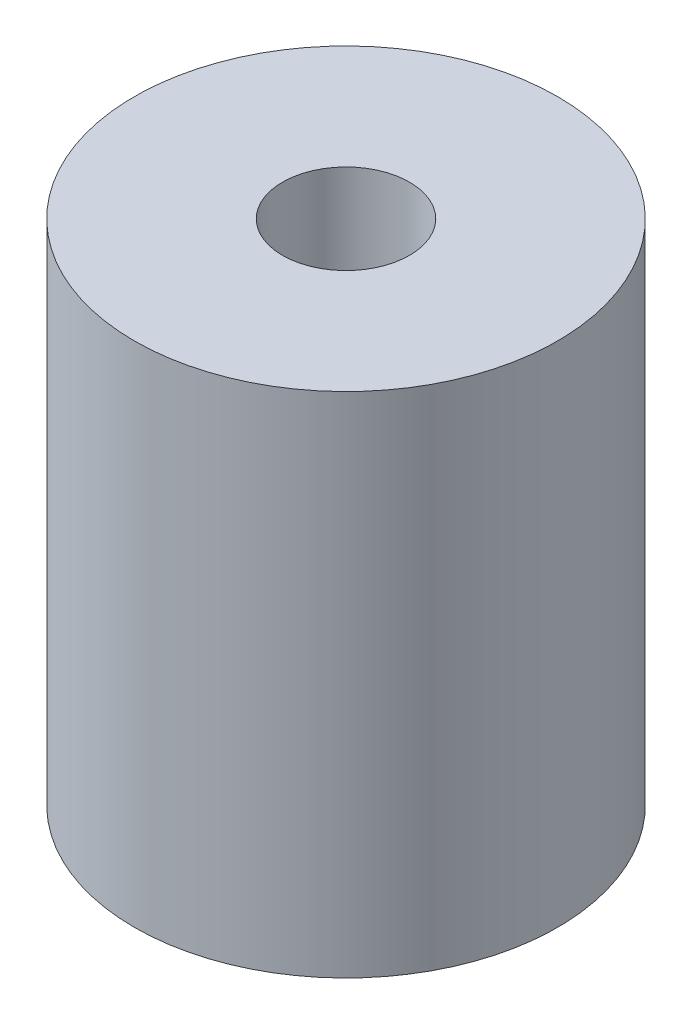
ISO-10303-21;
HEADER;
FILE_DESCRIPTION(('STEP AP214'),'2;1');
FILE_NAME('part.step','',(''),(''),'','','');
FILE_SCHEMA(('AUTOMOTIVE_DESIGN { 1 0 10303 214 1 1 1 1 }'));
ENDSEC;
DATA;
#1=APPLICATION_CONTEXT('core data for automotive mechanical design processes');
#2=APPLICATION_PROTOCOL_DEFINITION('international standard','automotive_design',2000,#1);
#3=PRODUCT_CONTEXT('',#1,'mechanical');
#4=PRODUCT('Part','Part','',(#3));
#5=PRODUCT_RELATED_PRODUCT_CATEGORY('part','',(#4));
#6=PRODUCT_DEFINITION_FORMATION('','',#4);
#7=PRODUCT_DEFINITION_CONTEXT('part definition',#1,'design');
#8=PRODUCT_DEFINITION('design','',#6,#7);
#9=PRODUCT_DEFINITION_SHAPE('','',#8);
#10=(LENGTH_UNIT() NAMED_UNIT(*) SI_UNIT(.MILLI.,.METRE.));
#11=(NAMED_UNIT(*) PLANE_ANGLE_UNIT() SI_UNIT($,.RADIAN.));
#12=(NAMED_UNIT(*) SI_UNIT($,.STERADIAN.) SOLID_ANGLE_UNIT());
#13=UNCERTAINTY_MEASURE_WITH_UNIT(LENGTH_MEASURE(1.E-05),#10,'distance_accuracy_value','');
#14=(GEOMETRIC_REPRESENTATION_CONTEXT(3) GLOBAL_UNCERTAINTY_ASSIGNED_CONTEXT((#13)) GLOBAL_UNIT_ASSIGNED_CONTEXT((#10,
#11,#12)) REPRESENTATION_CONTEXT('',''));
#15=CARTESIAN_POINT('',(0.,0.,0.));
#16=DIRECTION('',(0.,0.,1.));
#17=DIRECTION('',(1.,0.,0.));
#18=AXIS2_PLACEMENT_3D('',#15,#16,#17);
#19=CARTESIAN_POINT('',(0.,12.,0.));
#20=DIRECTION('',(0.,1.,0.));
#21=DIRECTION('',(0.,0.,1.));
#22=AXIS2_PLACEMENT_3D('',#19,#20,#21);
#23=PLANE('',#22);
#24=CARTESIAN_POINT('',(0.,12.,0.));
#25=DIRECTION('',(0.,1.,0.));
#26=DIRECTION('',(0.,0.,1.));
#27=AXIS2_PLACEMENT_3D('',#24,#25,#26);
#28=CIRCLE('',#27,5.);
#29=CARTESIAN_POINT('',(0.,12.,5.));
#30=VERTEX_POINT('',#29);
#31=EDGE_CURVE('E10',#30,#30,#28,.T.);
#32=ORIENTED_EDGE('',*,*,#31,.T.);
#33=EDGE_LOOP('',(#32));
#34=FACE_BOUND('',#33,.T.);
#35=CARTESIAN_POINT('',(0.,12.,0.));
#36=DIRECTION('',(0.,1.,0.));
#37=DIRECTION('',(0.,0.,1.));
#38=AXIS2_PLACEMENT_3D('',#35,#36,#37);
#39=CIRCLE('',#38,1.5);
#40=CARTESIAN_POINT('',(0.,12.,1.5));
#41=VERTEX_POINT('',#40);
#42=EDGE_CURVE('E50',#41,#41,#39,.T.);
#43=ORIENTED_EDGE('',*,*,#42,.F.);
#44=EDGE_LOOP('',(#43));
#45=FACE_BOUND('',#44,.T.);
#46=ADVANCED_FACE('F37',(#34,#45),#23,.T.);
#47=CARTESIAN_POINT('',(0.,0.,0.));
#48=DIRECTION('',(0.,1.,0.));
#49=DIRECTION('',(0.,0.,1.));
#50=AXIS2_PLACEMENT_3D('',#47,#48,#49);
#51=PLANE('',#50);
#52=CARTESIAN_POINT('',(0.,0.,0.));
#53=DIRECTION('',(0.,1.,0.));
#54=DIRECTION('',(0.,0.,1.));
#55=AXIS2_PLACEMENT_3D('',#52,#53,#54);
#56=CIRCLE('',#55,5.);
#57=CARTESIAN_POINT('',(0.,0.,5.));
#58=VERTEX_POINT('',#57);
#59=EDGE_CURVE('E41',#58,#58,#56,.T.);
#60=ORIENTED_EDGE('',*,*,#59,.F.);
#61=EDGE_LOOP('',(#60));
#62=FACE_BOUND('',#61,.T.);
#63=CARTESIAN_POINT('',(0.,0.,0.));
#64=DIRECTION('',(0.,1.,0.));
#65=DIRECTION('',(0.,0.,1.));
#66=AXIS2_PLACEMENT_3D('',#63,#64,#65);
#67=CIRCLE('',#66,1.5);
#68=CARTESIAN_POINT('',(0.,0.,1.5));
#69=VERTEX_POINT('',#68);
#70=EDGE_CURVE('E52',#69,#69,#67,.T.);
#71=ORIENTED_EDGE('',*,*,#70,.T.);
#72=EDGE_LOOP('',(#71));
#73=FACE_BOUND('',#72,.T.);
#74=ADVANCED_FACE('F64',(#62,#73),#51,.F.);
#75=CARTESIAN_POINT('',(0.,12.,0.));
#76=DIRECTION('',(0.,-1.,0.));
#77=DIRECTION('',(0.,0.,-1.));
#78=AXIS2_PLACEMENT_3D('',#75,#76,#77);
#79=CYLINDRICAL_SURFACE('',#78,5.);
#80=ORIENTED_EDGE('',*,*,#31,.F.);
#81=EDGE_LOOP('',(#80));
#82=FACE_BOUND('',#81,.T.);
#83=ORIENTED_EDGE('',*,*,#59,.T.);
#84=EDGE_LOOP('',(#83));
#85=FACE_BOUND('',#84,.T.);
#86=ADVANCED_FACE('F39',(#82,#85),#79,.T.);
#87=CARTESIAN_POINT('',(0.,12.,0.));
#88=DIRECTION('',(0.,-1.,0.));
#89=DIRECTION('',(0.,0.,-1.));
#90=AXIS2_PLACEMENT_3D('',#87,#88,#89);
#91=CYLINDRICAL_SURFACE('',#90,1.5);
#92=ORIENTED_EDGE('',*,*,#42,.T.);
#93=EDGE_LOOP('',(#92));
#94=FACE_BOUND('',#93,.T.);
#95=ORIENTED_EDGE('',*,*,#70,.F.);
#96=EDGE_LOOP('',(#95));
#97=FACE_BOUND('',#96,.T.);
#98=ADVANCED_FACE('F60',(#94,#97),#91,.F.);
#99=CLOSED_SHELL('',(#46,#74,#86,#98));
#100=MANIFOLD_SOLID_BREP('B2',#99);
#101=ADVANCED_BREP_SHAPE_REPRESENTATION('',(#18,#100),#14);
#102=SHAPE_DEFINITION_REPRESENTATION(#9,#101);
ENDSEC;
END-ISO-10303-21;
